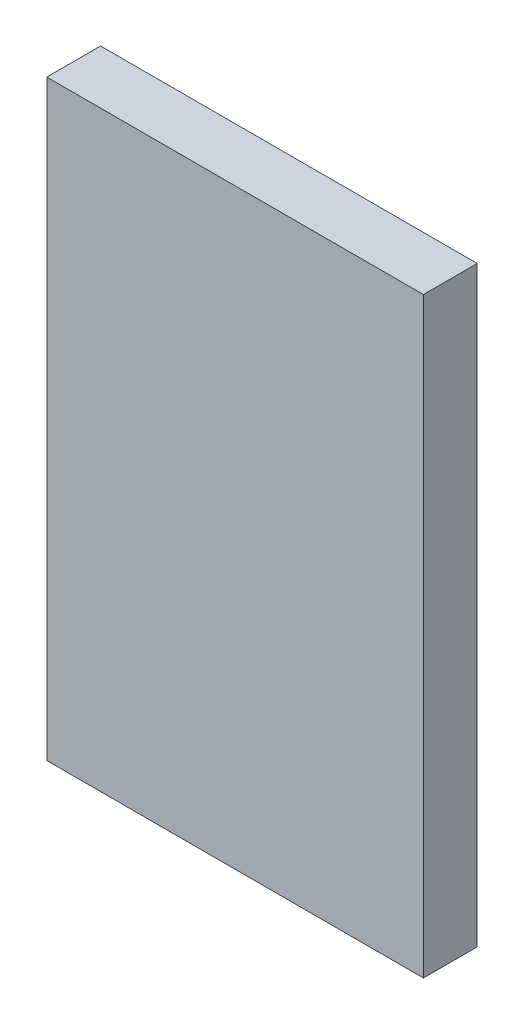
ISO-10303-21;
HEADER;
FILE_DESCRIPTION(('STEP AP214'),'2;1');
FILE_NAME('part.step','',(''),(''),'','','');
FILE_SCHEMA(('AUTOMOTIVE_DESIGN { 1 0 10303 214 1 1 1 1 }'));
ENDSEC;
DATA;
#1=APPLICATION_CONTEXT('core data for automotive mechanical design processes');
#2=APPLICATION_PROTOCOL_DEFINITION('international standard','automotive_design',2000,#1);
#3=PRODUCT_CONTEXT('',#1,'mechanical');
#4=PRODUCT('Part','Part','',(#3));
#5=PRODUCT_RELATED_PRODUCT_CATEGORY('part','',(#4));
#6=PRODUCT_DEFINITION_FORMATION('','',#4);
#7=PRODUCT_DEFINITION_CONTEXT('part definition',#1,'design');
#8=PRODUCT_DEFINITION('design','',#6,#7);
#9=PRODUCT_DEFINITION_SHAPE('','',#8);
#10=(LENGTH_UNIT() NAMED_UNIT(*) SI_UNIT(.MILLI.,.METRE.));
#11=(NAMED_UNIT(*) PLANE_ANGLE_UNIT() SI_UNIT($,.RADIAN.));
#12=(NAMED_UNIT(*) SI_UNIT($,.STERADIAN.) SOLID_ANGLE_UNIT());
#13=UNCERTAINTY_MEASURE_WITH_UNIT(LENGTH_MEASURE(1.E-05),#10,'distance_accuracy_value','');
#14=(GEOMETRIC_REPRESENTATION_CONTEXT(3) GLOBAL_UNCERTAINTY_ASSIGNED_CONTEXT((#13)) GLOBAL_UNIT_ASSIGNED_CONTEXT((#10,
#11,#12)) REPRESENTATION_CONTEXT('',''));
#15=CARTESIAN_POINT('',(0.,0.,0.));
#16=DIRECTION('',(0.,0.,1.));
#17=DIRECTION('',(1.,0.,0.));
#18=AXIS2_PLACEMENT_3D('',#15,#16,#17);
#19=CARTESIAN_POINT('',(88.9,-139.7,25.4));
#20=DIRECTION('',(-1.,0.,0.));
#21=DIRECTION('',(0.,0.,1.));
#22=AXIS2_PLACEMENT_3D('',#19,#20,#21);
#23=PLANE('',#22);
#24=DIRECTION('',(0.,1.,0.));
#25=VECTOR('',#24,1.);
#26=CARTESIAN_POINT('',(88.9,-139.7,0.));
#27=LINE('',#26,#25);
#28=CARTESIAN_POINT('',(88.9,-139.7,0.));
#29=VERTEX_POINT('',#28);
#30=CARTESIAN_POINT('',(88.9,139.7,0.));
#31=VERTEX_POINT('',#30);
#32=EDGE_CURVE('E113',#29,#31,#27,.T.);
#33=ORIENTED_EDGE('',*,*,#32,.T.);
#34=DIRECTION('',(0.,0.,-1.));
#35=VECTOR('',#34,1.);
#36=CARTESIAN_POINT('',(88.9,139.7,25.4));
#37=LINE('',#36,#35);
#38=CARTESIAN_POINT('',(88.9,139.7,25.4));
#39=VERTEX_POINT('',#38);
#40=EDGE_CURVE('E11',#39,#31,#37,.T.);
#41=ORIENTED_EDGE('',*,*,#40,.F.);
#42=DIRECTION('',(0.,1.,0.));
#43=VECTOR('',#42,1.);
#44=CARTESIAN_POINT('',(88.9,-139.7,25.4));
#45=LINE('',#44,#43);
#46=CARTESIAN_POINT('',(88.9,-139.7,25.4));
#47=VERTEX_POINT('',#46);
#48=EDGE_CURVE('E97',#47,#39,#45,.T.);
#49=ORIENTED_EDGE('',*,*,#48,.F.);
#50=DIRECTION('',(0.,0.,-1.));
#51=VECTOR('',#50,1.);
#52=CARTESIAN_POINT('',(88.9,-139.7,25.4));
#53=LINE('',#52,#51);
#54=EDGE_CURVE('E109',#47,#29,#53,.T.);
#55=ORIENTED_EDGE('',*,*,#54,.T.);
#56=EDGE_LOOP('',(#33,#41,#49,#55));
#57=FACE_BOUND('',#56,.T.);
#58=ADVANCED_FACE('F45',(#57),#23,.F.);
#59=CARTESIAN_POINT('',(-88.9,139.7,25.4));
#60=DIRECTION('',(0.,-1.,0.));
#61=DIRECTION('',(0.,0.,-1.));
#62=AXIS2_PLACEMENT_3D('',#59,#60,#61);
#63=PLANE('',#62);
#64=DIRECTION('',(-1.,0.,0.));
#65=VECTOR('',#64,1.);
#66=CARTESIAN_POINT('',(-88.9,139.7,0.));
#67=LINE('',#66,#65);
#68=CARTESIAN_POINT('',(-88.9,139.7,0.));
#69=VERTEX_POINT('',#68);
#70=EDGE_CURVE('E102',#31,#69,#67,.T.);
#71=ORIENTED_EDGE('',*,*,#70,.T.);
#72=DIRECTION('',(0.,0.,-1.));
#73=VECTOR('',#72,1.);
#74=CARTESIAN_POINT('',(-88.9,139.7,25.4));
#75=LINE('',#74,#73);
#76=CARTESIAN_POINT('',(-88.9,139.7,25.4));
#77=VERTEX_POINT('',#76);
#78=EDGE_CURVE('E54',#77,#69,#75,.T.);
#79=ORIENTED_EDGE('',*,*,#78,.F.);
#80=DIRECTION('',(-1.,0.,0.));
#81=VECTOR('',#80,1.);
#82=CARTESIAN_POINT('',(-88.9,139.7,25.4));
#83=LINE('',#82,#81);
#84=EDGE_CURVE('E92',#39,#77,#83,.T.);
#85=ORIENTED_EDGE('',*,*,#84,.F.);
#86=ORIENTED_EDGE('',*,*,#40,.T.);
#87=EDGE_LOOP('',(#71,#79,#85,#86));
#88=FACE_BOUND('',#87,.T.);
#89=ADVANCED_FACE('F101',(#88),#63,.F.);
#90=CARTESIAN_POINT('',(-88.9,-139.7,25.4));
#91=DIRECTION('',(1.,0.,0.));
#92=DIRECTION('',(0.,0.,-1.));
#93=AXIS2_PLACEMENT_3D('',#90,#91,#92);
#94=PLANE('',#93);
#95=DIRECTION('',(0.,-1.,0.));
#96=VECTOR('',#95,1.);
#97=CARTESIAN_POINT('',(-88.9,-139.7,0.));
#98=LINE('',#97,#96);
#99=CARTESIAN_POINT('',(-88.9,-139.7,0.));
#100=VERTEX_POINT('',#99);
#101=EDGE_CURVE('E79',#69,#100,#98,.T.);
#102=ORIENTED_EDGE('',*,*,#101,.T.);
#103=DIRECTION('',(0.,0.,-1.));
#104=VECTOR('',#103,1.);
#105=CARTESIAN_POINT('',(-88.9,-139.7,25.4));
#106=LINE('',#105,#104);
#107=CARTESIAN_POINT('',(-88.9,-139.7,25.4));
#108=VERTEX_POINT('',#107);
#109=EDGE_CURVE('E104',#108,#100,#106,.T.);
#110=ORIENTED_EDGE('',*,*,#109,.F.);
#111=DIRECTION('',(0.,-1.,0.));
#112=VECTOR('',#111,1.);
#113=CARTESIAN_POINT('',(-88.9,-139.7,25.4));
#114=LINE('',#113,#112);
#115=EDGE_CURVE('E95',#77,#108,#114,.T.);
#116=ORIENTED_EDGE('',*,*,#115,.F.);
#117=ORIENTED_EDGE('',*,*,#78,.T.);
#118=EDGE_LOOP('',(#102,#110,#116,#117));
#119=FACE_BOUND('',#118,.T.);
#120=ADVANCED_FACE('F105',(#119),#94,.F.);
#121=CARTESIAN_POINT('',(-88.9,-139.7,25.4));
#122=DIRECTION('',(0.,1.,0.));
#123=DIRECTION('',(0.,0.,1.));
#124=AXIS2_PLACEMENT_3D('',#121,#122,#123);
#125=PLANE('',#124);
#126=DIRECTION('',(1.,0.,0.));
#127=VECTOR('',#126,1.);
#128=CARTESIAN_POINT('',(-88.9,-139.7,0.));
#129=LINE('',#128,#127);
#130=EDGE_CURVE('E85',#100,#29,#129,.T.);
#131=ORIENTED_EDGE('',*,*,#130,.T.);
#132=ORIENTED_EDGE('',*,*,#54,.F.);
#133=DIRECTION('',(1.,0.,0.));
#134=VECTOR('',#133,1.);
#135=CARTESIAN_POINT('',(-88.9,-139.7,25.4));
#136=LINE('',#135,#134);
#137=EDGE_CURVE('E62',#108,#47,#136,.T.);
#138=ORIENTED_EDGE('',*,*,#137,.F.);
#139=ORIENTED_EDGE('',*,*,#109,.T.);
#140=EDGE_LOOP('',(#131,#132,#138,#139));
#141=FACE_BOUND('',#140,.T.);
#142=ADVANCED_FACE('F126',(#141),#125,.F.);
#143=CARTESIAN_POINT('',(0.,0.,25.4));
#144=DIRECTION('',(0.,0.,-1.));
#145=DIRECTION('',(-1.,0.,0.));
#146=AXIS2_PLACEMENT_3D('',#143,#144,#145);
#147=PLANE('',#146);
#148=ORIENTED_EDGE('',*,*,#48,.T.);
#149=ORIENTED_EDGE('',*,*,#84,.T.);
#150=ORIENTED_EDGE('',*,*,#115,.T.);
#151=ORIENTED_EDGE('',*,*,#137,.T.);
#152=EDGE_LOOP('',(#148,#149,#150,#151));
#153=FACE_BOUND('',#152,.T.);
#154=ADVANCED_FACE('F93',(#153),#147,.F.);
#155=CARTESIAN_POINT('',(0.,0.,0.));
#156=DIRECTION('',(0.,0.,-1.));
#157=DIRECTION('',(-1.,0.,0.));
#158=AXIS2_PLACEMENT_3D('',#155,#156,#157);
#159=PLANE('',#158);
#160=ORIENTED_EDGE('',*,*,#32,.F.);
#161=ORIENTED_EDGE('',*,*,#130,.F.);
#162=ORIENTED_EDGE('',*,*,#101,.F.);
#163=ORIENTED_EDGE('',*,*,#70,.F.);
#164=EDGE_LOOP('',(#160,#161,#162,#163));
#165=FACE_BOUND('',#164,.T.);
#166=ADVANCED_FACE('F129',(#165),#159,.T.);
#167=CLOSED_SHELL('',(#58,#89,#120,#142,#154,#166));
#168=MANIFOLD_SOLID_BREP('B2',#167);
#169=ADVANCED_BREP_SHAPE_REPRESENTATION('',(#18,#168),#14);
#170=SHAPE_DEFINITION_REPRESENTATION(#9,#169);
ENDSEC;
END-ISO-10303-21;
